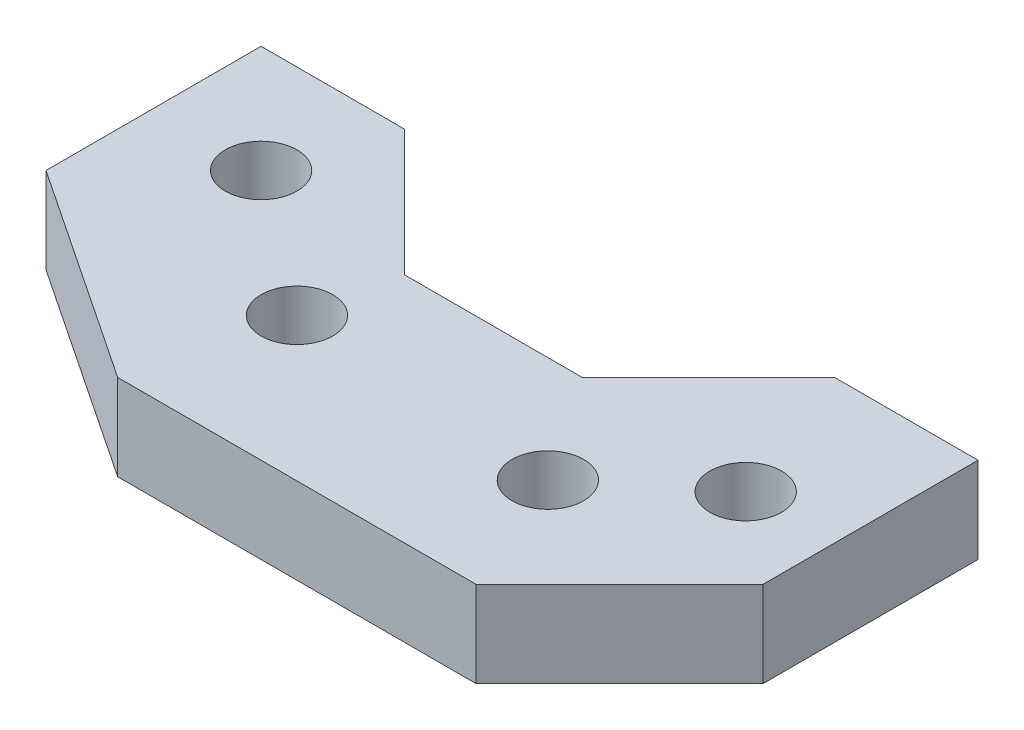
ISO-10303-21;
HEADER;
FILE_DESCRIPTION(('STEP AP214'),'2;1');
FILE_NAME('part.step','',(''),(''),'','','');
FILE_SCHEMA(('AUTOMOTIVE_DESIGN { 1 0 10303 214 1 1 1 1 }'));
ENDSEC;
DATA;
#1=APPLICATION_CONTEXT('core data for automotive mechanical design processes');
#2=APPLICATION_PROTOCOL_DEFINITION('international standard','automotive_design',2000,#1);
#3=PRODUCT_CONTEXT('',#1,'mechanical');
#4=PRODUCT('Part','Part','',(#3));
#5=PRODUCT_RELATED_PRODUCT_CATEGORY('part','',(#4));
#6=PRODUCT_DEFINITION_FORMATION('','',#4);
#7=PRODUCT_DEFINITION_CONTEXT('part definition',#1,'design');
#8=PRODUCT_DEFINITION('design','',#6,#7);
#9=PRODUCT_DEFINITION_SHAPE('','',#8);
#10=(LENGTH_UNIT() NAMED_UNIT(*) SI_UNIT(.MILLI.,.METRE.));
#11=(NAMED_UNIT(*) PLANE_ANGLE_UNIT() SI_UNIT($,.RADIAN.));
#12=(NAMED_UNIT(*) SI_UNIT($,.STERADIAN.) SOLID_ANGLE_UNIT());
#13=UNCERTAINTY_MEASURE_WITH_UNIT(LENGTH_MEASURE(1.E-05),#10,'distance_accuracy_value','');
#14=(GEOMETRIC_REPRESENTATION_CONTEXT(3) GLOBAL_UNCERTAINTY_ASSIGNED_CONTEXT((#13)) GLOBAL_UNIT_ASSIGNED_CONTEXT((#10,
#11,#12)) REPRESENTATION_CONTEXT('',''));
#15=CARTESIAN_POINT('',(0.,0.,0.));
#16=DIRECTION('',(0.,0.,1.));
#17=DIRECTION('',(1.,0.,0.));
#18=AXIS2_PLACEMENT_3D('',#15,#16,#17);
#19=CARTESIAN_POINT('',(0.,15.24,0.));
#20=DIRECTION('',(0.,1.,0.));
#21=DIRECTION('',(0.,0.,1.));
#22=AXIS2_PLACEMENT_3D('',#19,#20,#21);
#23=PLANE('',#22);
#24=CARTESIAN_POINT('',(111.252,15.24,25.4));
#25=DIRECTION('',(0.,1.,0.));
#26=DIRECTION('',(0.,0.,1.));
#27=AXIS2_PLACEMENT_3D('',#24,#25,#26);
#28=CIRCLE('',#27,6.35000000000001);
#29=CARTESIAN_POINT('',(111.252,15.24,31.75));
#30=VERTEX_POINT('',#29);
#31=EDGE_CURVE('E257',#30,#30,#28,.T.);
#32=ORIENTED_EDGE('',*,*,#31,.F.);
#33=EDGE_LOOP('',(#32));
#34=FACE_BOUND('',#33,.T.);
#35=CARTESIAN_POINT('',(44.45,15.24,38.1));
#36=DIRECTION('',(0.,1.,0.));
#37=DIRECTION('',(0.,0.,1.));
#38=AXIS2_PLACEMENT_3D('',#35,#36,#37);
#39=CIRCLE('',#38,6.35);
#40=CARTESIAN_POINT('',(44.45,15.24,44.45));
#41=VERTEX_POINT('',#40);
#42=EDGE_CURVE('E158',#41,#41,#39,.T.);
#43=ORIENTED_EDGE('',*,*,#42,.F.);
#44=EDGE_LOOP('',(#43));
#45=FACE_BOUND('',#44,.T.);
#46=DIRECTION('',(-1.,0.,0.));
#47=VECTOR('',#46,1.);
#48=CARTESIAN_POINT('',(25.4,15.24,0.));
#49=LINE('',#48,#47);
#50=CARTESIAN_POINT('',(25.4,15.24,0.));
#51=VERTEX_POINT('',#50);
#52=CARTESIAN_POINT('',(0.,15.24,0.));
#53=VERTEX_POINT('',#52);
#54=EDGE_CURVE('E182',#51,#53,#49,.T.);
#55=ORIENTED_EDGE('',*,*,#54,.T.);
#56=DIRECTION('',(0.,0.,1.));
#57=VECTOR('',#56,1.);
#58=CARTESIAN_POINT('',(0.,15.24,0.));
#59=LINE('',#58,#57);
#60=CARTESIAN_POINT('',(0.,15.24,38.1));
#61=VERTEX_POINT('',#60);
#62=EDGE_CURVE('E106',#53,#61,#59,.T.);
#63=ORIENTED_EDGE('',*,*,#62,.T.);
#64=DIRECTION('',(0.832050294337844,0.,0.554700196225229));
#65=VECTOR('',#64,1.);
#66=CARTESIAN_POINT('',(0.,15.24,38.1));
#67=LINE('',#66,#65);
#68=CARTESIAN_POINT('',(38.1,15.24,63.5));
#69=VERTEX_POINT('',#68);
#70=EDGE_CURVE('E211',#61,#69,#67,.T.);
#71=ORIENTED_EDGE('',*,*,#70,.T.);
#72=DIRECTION('',(1.,0.,0.));
#73=VECTOR('',#72,1.);
#74=CARTESIAN_POINT('',(38.1,15.24,63.5));
#75=LINE('',#74,#73);
#76=CARTESIAN_POINT('',(101.6,15.24,63.5));
#77=VERTEX_POINT('',#76);
#78=EDGE_CURVE('E231',#69,#77,#75,.T.);
#79=ORIENTED_EDGE('',*,*,#78,.T.);
#80=DIRECTION('',(0.707106781186546,0.,-0.707106781186549));
#81=VECTOR('',#80,1.);
#82=CARTESIAN_POINT('',(101.6,15.24,63.5));
#83=LINE('',#82,#81);
#84=CARTESIAN_POINT('',(127.,15.24,38.0999999999999));
#85=VERTEX_POINT('',#84);
#86=EDGE_CURVE('E227',#77,#85,#83,.T.);
#87=ORIENTED_EDGE('',*,*,#86,.T.);
#88=DIRECTION('',(0.,0.,-1.));
#89=VECTOR('',#88,1.);
#90=CARTESIAN_POINT('',(127.,15.24,38.0999999999999));
#91=LINE('',#90,#89);
#92=CARTESIAN_POINT('',(127.,15.24,0.));
#93=VERTEX_POINT('',#92);
#94=EDGE_CURVE('E230',#85,#93,#91,.T.);
#95=ORIENTED_EDGE('',*,*,#94,.T.);
#96=DIRECTION('',(-1.,0.,0.));
#97=VECTOR('',#96,1.);
#98=CARTESIAN_POINT('',(127.,15.24,0.));
#99=LINE('',#98,#97);
#100=CARTESIAN_POINT('',(101.6,15.24,0.));
#101=VERTEX_POINT('',#100);
#102=EDGE_CURVE('E131',#93,#101,#99,.T.);
#103=ORIENTED_EDGE('',*,*,#102,.T.);
#104=DIRECTION('',(-0.707106781186547,0.,0.707106781186548));
#105=VECTOR('',#104,1.);
#106=CARTESIAN_POINT('',(101.6,15.24,0.));
#107=LINE('',#106,#105);
#108=CARTESIAN_POINT('',(79.248,15.24,22.352));
#109=VERTEX_POINT('',#108);
#110=EDGE_CURVE('E125',#101,#109,#107,.T.);
#111=ORIENTED_EDGE('',*,*,#110,.T.);
#112=DIRECTION('',(-1.,0.,0.));
#113=VECTOR('',#112,1.);
#114=CARTESIAN_POINT('',(47.752,15.24,22.352));
#115=LINE('',#114,#113);
#116=CARTESIAN_POINT('',(47.752,15.24,22.352));
#117=VERTEX_POINT('',#116);
#118=EDGE_CURVE('E129',#109,#117,#115,.T.);
#119=ORIENTED_EDGE('',*,*,#118,.T.);
#120=DIRECTION('',(-0.707106781186548,0.,-0.707106781186547));
#121=VECTOR('',#120,1.);
#122=CARTESIAN_POINT('',(47.752,15.24,22.352));
#123=LINE('',#122,#121);
#124=EDGE_CURVE('E57',#117,#51,#123,.T.);
#125=ORIENTED_EDGE('',*,*,#124,.T.);
#126=EDGE_LOOP('',(#55,#63,#71,#79,#87,#95,#103,#111,#119,#125));
#127=FACE_BOUND('',#126,.T.);
#128=CARTESIAN_POINT('',(91.948,15.24,41.148));
#129=DIRECTION('',(0.,1.,0.));
#130=DIRECTION('',(0.,0.,1.));
#131=AXIS2_PLACEMENT_3D('',#128,#129,#130);
#132=CIRCLE('',#131,6.35000000000002);
#133=CARTESIAN_POINT('',(91.948,15.24,47.498));
#134=VERTEX_POINT('',#133);
#135=EDGE_CURVE('E249',#134,#134,#132,.T.);
#136=ORIENTED_EDGE('',*,*,#135,.F.);
#137=EDGE_LOOP('',(#136));
#138=FACE_BOUND('',#137,.T.);
#139=CARTESIAN_POINT('',(19.05,15.24,19.05));
#140=DIRECTION('',(0.,1.,0.));
#141=DIRECTION('',(0.,0.,1.));
#142=AXIS2_PLACEMENT_3D('',#139,#140,#141);
#143=CIRCLE('',#142,6.35);
#144=CARTESIAN_POINT('',(19.05,15.24,25.4));
#145=VERTEX_POINT('',#144);
#146=EDGE_CURVE('E265',#145,#145,#143,.T.);
#147=ORIENTED_EDGE('',*,*,#146,.F.);
#148=EDGE_LOOP('',(#147));
#149=FACE_BOUND('',#148,.T.);
#150=ADVANCED_FACE('F39',(#34,#45,#127,#138,#149),#23,.T.);
#151=CARTESIAN_POINT('',(0.,0.,0.));
#152=DIRECTION('',(0.,1.,0.));
#153=DIRECTION('',(0.,0.,1.));
#154=AXIS2_PLACEMENT_3D('',#151,#152,#153);
#155=PLANE('',#154);
#156=DIRECTION('',(-1.,0.,0.));
#157=VECTOR('',#156,1.);
#158=CARTESIAN_POINT('',(25.4,0.,0.));
#159=LINE('',#158,#157);
#160=CARTESIAN_POINT('',(25.4,0.,0.));
#161=VERTEX_POINT('',#160);
#162=CARTESIAN_POINT('',(0.,0.,0.));
#163=VERTEX_POINT('',#162);
#164=EDGE_CURVE('E153',#161,#163,#159,.T.);
#165=ORIENTED_EDGE('',*,*,#164,.F.);
#166=DIRECTION('',(-0.707106781186548,0.,-0.707106781186547));
#167=VECTOR('',#166,1.);
#168=CARTESIAN_POINT('',(47.752,0.,22.352));
#169=LINE('',#168,#167);
#170=CARTESIAN_POINT('',(47.752,0.,22.352));
#171=VERTEX_POINT('',#170);
#172=EDGE_CURVE('E98',#171,#161,#169,.T.);
#173=ORIENTED_EDGE('',*,*,#172,.F.);
#174=DIRECTION('',(-1.,0.,0.));
#175=VECTOR('',#174,1.);
#176=CARTESIAN_POINT('',(47.752,0.,22.352));
#177=LINE('',#176,#175);
#178=CARTESIAN_POINT('',(79.248,0.,22.352));
#179=VERTEX_POINT('',#178);
#180=EDGE_CURVE('E92',#179,#171,#177,.T.);
#181=ORIENTED_EDGE('',*,*,#180,.F.);
#182=DIRECTION('',(-0.707106781186547,0.,0.707106781186548));
#183=VECTOR('',#182,1.);
#184=CARTESIAN_POINT('',(101.6,0.,0.));
#185=LINE('',#184,#183);
#186=CARTESIAN_POINT('',(101.6,0.,0.));
#187=VERTEX_POINT('',#186);
#188=EDGE_CURVE('E140',#187,#179,#185,.T.);
#189=ORIENTED_EDGE('',*,*,#188,.F.);
#190=DIRECTION('',(-1.,0.,0.));
#191=VECTOR('',#190,1.);
#192=CARTESIAN_POINT('',(127.,0.,0.));
#193=LINE('',#192,#191);
#194=CARTESIAN_POINT('',(127.,0.,0.));
#195=VERTEX_POINT('',#194);
#196=EDGE_CURVE('E173',#195,#187,#193,.T.);
#197=ORIENTED_EDGE('',*,*,#196,.F.);
#198=DIRECTION('',(0.,0.,-1.));
#199=VECTOR('',#198,1.);
#200=CARTESIAN_POINT('',(127.,0.,38.0999999999999));
#201=LINE('',#200,#199);
#202=CARTESIAN_POINT('',(127.,0.,38.0999999999999));
#203=VERTEX_POINT('',#202);
#204=EDGE_CURVE('E170',#203,#195,#201,.T.);
#205=ORIENTED_EDGE('',*,*,#204,.F.);
#206=DIRECTION('',(0.707106781186546,0.,-0.707106781186549));
#207=VECTOR('',#206,1.);
#208=CARTESIAN_POINT('',(101.6,0.,63.5));
#209=LINE('',#208,#207);
#210=CARTESIAN_POINT('',(101.6,0.,63.5));
#211=VERTEX_POINT('',#210);
#212=EDGE_CURVE('E167',#211,#203,#209,.T.);
#213=ORIENTED_EDGE('',*,*,#212,.F.);
#214=DIRECTION('',(1.,0.,0.));
#215=VECTOR('',#214,1.);
#216=CARTESIAN_POINT('',(38.1,0.,63.5));
#217=LINE('',#216,#215);
#218=CARTESIAN_POINT('',(38.1,0.,63.5));
#219=VERTEX_POINT('',#218);
#220=EDGE_CURVE('E164',#219,#211,#217,.T.);
#221=ORIENTED_EDGE('',*,*,#220,.F.);
#222=DIRECTION('',(0.832050294337844,0.,0.554700196225229));
#223=VECTOR('',#222,1.);
#224=CARTESIAN_POINT('',(0.,0.,38.1));
#225=LINE('',#224,#223);
#226=CARTESIAN_POINT('',(0.,0.,38.1));
#227=VERTEX_POINT('',#226);
#228=EDGE_CURVE('E161',#227,#219,#225,.T.);
#229=ORIENTED_EDGE('',*,*,#228,.F.);
#230=DIRECTION('',(0.,0.,1.));
#231=VECTOR('',#230,1.);
#232=CARTESIAN_POINT('',(0.,0.,0.));
#233=LINE('',#232,#231);
#234=EDGE_CURVE('E157',#163,#227,#233,.T.);
#235=ORIENTED_EDGE('',*,*,#234,.F.);
#236=EDGE_LOOP('',(#165,#173,#181,#189,#197,#205,#213,#221,#229,#235));
#237=FACE_BOUND('',#236,.T.);
#238=CARTESIAN_POINT('',(44.45,0.,38.1));
#239=DIRECTION('',(0.,1.,0.));
#240=DIRECTION('',(0.,0.,1.));
#241=AXIS2_PLACEMENT_3D('',#238,#239,#240);
#242=CIRCLE('',#241,6.35);
#243=CARTESIAN_POINT('',(44.45,0.,44.45));
#244=VERTEX_POINT('',#243);
#245=EDGE_CURVE('E245',#244,#244,#242,.T.);
#246=ORIENTED_EDGE('',*,*,#245,.T.);
#247=EDGE_LOOP('',(#246));
#248=FACE_BOUND('',#247,.T.);
#249=CARTESIAN_POINT('',(91.948,0.,41.148));
#250=DIRECTION('',(0.,1.,0.));
#251=DIRECTION('',(0.,0.,1.));
#252=AXIS2_PLACEMENT_3D('',#249,#250,#251);
#253=CIRCLE('',#252,6.35000000000002);
#254=CARTESIAN_POINT('',(91.948,0.,47.498));
#255=VERTEX_POINT('',#254);
#256=EDGE_CURVE('E253',#255,#255,#253,.T.);
#257=ORIENTED_EDGE('',*,*,#256,.T.);
#258=EDGE_LOOP('',(#257));
#259=FACE_BOUND('',#258,.T.);
#260=CARTESIAN_POINT('',(111.252,0.,25.4));
#261=DIRECTION('',(0.,1.,0.));
#262=DIRECTION('',(0.,0.,1.));
#263=AXIS2_PLACEMENT_3D('',#260,#261,#262);
#264=CIRCLE('',#263,6.35000000000001);
#265=CARTESIAN_POINT('',(111.252,0.,31.75));
#266=VERTEX_POINT('',#265);
#267=EDGE_CURVE('E261',#266,#266,#264,.T.);
#268=ORIENTED_EDGE('',*,*,#267,.T.);
#269=EDGE_LOOP('',(#268));
#270=FACE_BOUND('',#269,.T.);
#271=CARTESIAN_POINT('',(19.05,0.,19.05));
#272=DIRECTION('',(0.,1.,0.));
#273=DIRECTION('',(0.,0.,1.));
#274=AXIS2_PLACEMENT_3D('',#271,#272,#273);
#275=CIRCLE('',#274,6.35);
#276=CARTESIAN_POINT('',(19.05,0.,25.4));
#277=VERTEX_POINT('',#276);
#278=EDGE_CURVE('E269',#277,#277,#275,.T.);
#279=ORIENTED_EDGE('',*,*,#278,.T.);
#280=EDGE_LOOP('',(#279));
#281=FACE_BOUND('',#280,.T.);
#282=ADVANCED_FACE('F215',(#237,#248,#259,#270,#281),#155,.F.);
#283=CARTESIAN_POINT('',(25.4,15.24,0.));
#284=DIRECTION('',(0.,0.,1.));
#285=DIRECTION('',(1.,0.,0.));
#286=AXIS2_PLACEMENT_3D('',#283,#284,#285);
#287=PLANE('',#286);
#288=ORIENTED_EDGE('',*,*,#164,.T.);
#289=DIRECTION('',(0.,-1.,0.));
#290=VECTOR('',#289,1.);
#291=CARTESIAN_POINT('',(0.,15.24,0.));
#292=LINE('',#291,#290);
#293=EDGE_CURVE('E11',#53,#163,#292,.T.);
#294=ORIENTED_EDGE('',*,*,#293,.F.);
#295=ORIENTED_EDGE('',*,*,#54,.F.);
#296=DIRECTION('',(0.,-1.,0.));
#297=VECTOR('',#296,1.);
#298=CARTESIAN_POINT('',(25.4,15.24,0.));
#299=LINE('',#298,#297);
#300=EDGE_CURVE('E149',#51,#161,#299,.T.);
#301=ORIENTED_EDGE('',*,*,#300,.T.);
#302=EDGE_LOOP('',(#288,#294,#295,#301));
#303=FACE_BOUND('',#302,.T.);
#304=ADVANCED_FACE('F41',(#303),#287,.F.);
#305=CARTESIAN_POINT('',(0.,15.24,0.));
#306=DIRECTION('',(1.,0.,0.));
#307=DIRECTION('',(0.,0.,-1.));
#308=AXIS2_PLACEMENT_3D('',#305,#306,#307);
#309=PLANE('',#308);
#310=ORIENTED_EDGE('',*,*,#234,.T.);
#311=DIRECTION('',(0.,-1.,0.));
#312=VECTOR('',#311,1.);
#313=CARTESIAN_POINT('',(0.,15.24,38.1));
#314=LINE('',#313,#312);
#315=EDGE_CURVE('E49',#61,#227,#314,.T.);
#316=ORIENTED_EDGE('',*,*,#315,.F.);
#317=ORIENTED_EDGE('',*,*,#62,.F.);
#318=ORIENTED_EDGE('',*,*,#293,.T.);
#319=EDGE_LOOP('',(#310,#316,#317,#318));
#320=FACE_BOUND('',#319,.T.);
#321=ADVANCED_FACE('F313',(#320),#309,.F.);
#322=CARTESIAN_POINT('',(0.,15.24,38.1));
#323=DIRECTION('',(0.554700196225229,0.,-0.832050294337844));
#324=DIRECTION('',(-0.832050294337844,0.,-0.554700196225229));
#325=AXIS2_PLACEMENT_3D('',#322,#323,#324);
#326=PLANE('',#325);
#327=ORIENTED_EDGE('',*,*,#228,.T.);
#328=DIRECTION('',(0.,-1.,0.));
#329=VECTOR('',#328,1.);
#330=CARTESIAN_POINT('',(38.1,15.24,63.5));
#331=LINE('',#330,#329);
#332=EDGE_CURVE('E201',#69,#219,#331,.T.);
#333=ORIENTED_EDGE('',*,*,#332,.F.);
#334=ORIENTED_EDGE('',*,*,#70,.F.);
#335=ORIENTED_EDGE('',*,*,#315,.T.);
#336=EDGE_LOOP('',(#327,#333,#334,#335));
#337=FACE_BOUND('',#336,.T.);
#338=ADVANCED_FACE('F209',(#337),#326,.F.);
#339=CARTESIAN_POINT('',(38.1,15.24,63.5));
#340=DIRECTION('',(0.,0.,-1.));
#341=DIRECTION('',(-1.,0.,0.));
#342=AXIS2_PLACEMENT_3D('',#339,#340,#341);
#343=PLANE('',#342);
#344=ORIENTED_EDGE('',*,*,#220,.T.);
#345=DIRECTION('',(0.,-1.,0.));
#346=VECTOR('',#345,1.);
#347=CARTESIAN_POINT('',(101.6,15.24,63.5));
#348=LINE('',#347,#346);
#349=EDGE_CURVE('E197',#77,#211,#348,.T.);
#350=ORIENTED_EDGE('',*,*,#349,.F.);
#351=ORIENTED_EDGE('',*,*,#78,.F.);
#352=ORIENTED_EDGE('',*,*,#332,.T.);
#353=EDGE_LOOP('',(#344,#350,#351,#352));
#354=FACE_BOUND('',#353,.T.);
#355=ADVANCED_FACE('F221',(#354),#343,.F.);
#356=CARTESIAN_POINT('',(101.6,15.24,63.5));
#357=DIRECTION('',(-0.707106781186549,0.,-0.707106781186546));
#358=DIRECTION('',(-0.707106781186546,0.,0.707106781186549));
#359=AXIS2_PLACEMENT_3D('',#356,#357,#358);
#360=PLANE('',#359);
#361=ORIENTED_EDGE('',*,*,#212,.T.);
#362=DIRECTION('',(0.,-1.,0.));
#363=VECTOR('',#362,1.);
#364=CARTESIAN_POINT('',(127.,15.24,38.0999999999999));
#365=LINE('',#364,#363);
#366=EDGE_CURVE('E193',#85,#203,#365,.T.);
#367=ORIENTED_EDGE('',*,*,#366,.F.);
#368=ORIENTED_EDGE('',*,*,#86,.F.);
#369=ORIENTED_EDGE('',*,*,#349,.T.);
#370=EDGE_LOOP('',(#361,#367,#368,#369));
#371=FACE_BOUND('',#370,.T.);
#372=ADVANCED_FACE('F225',(#371),#360,.F.);
#373=CARTESIAN_POINT('',(127.,15.24,38.0999999999999));
#374=DIRECTION('',(-1.,0.,0.));
#375=DIRECTION('',(0.,0.,1.));
#376=AXIS2_PLACEMENT_3D('',#373,#374,#375);
#377=PLANE('',#376);
#378=ORIENTED_EDGE('',*,*,#204,.T.);
#379=DIRECTION('',(0.,-1.,0.));
#380=VECTOR('',#379,1.);
#381=CARTESIAN_POINT('',(127.,15.24,0.));
#382=LINE('',#381,#380);
#383=EDGE_CURVE('E189',#93,#195,#382,.T.);
#384=ORIENTED_EDGE('',*,*,#383,.F.);
#385=ORIENTED_EDGE('',*,*,#94,.F.);
#386=ORIENTED_EDGE('',*,*,#366,.T.);
#387=EDGE_LOOP('',(#378,#384,#385,#386));
#388=FACE_BOUND('',#387,.T.);
#389=ADVANCED_FACE('F303',(#388),#377,.F.);
#390=CARTESIAN_POINT('',(127.,15.24,0.));
#391=DIRECTION('',(0.,0.,1.));
#392=DIRECTION('',(1.,0.,0.));
#393=AXIS2_PLACEMENT_3D('',#390,#391,#392);
#394=PLANE('',#393);
#395=ORIENTED_EDGE('',*,*,#196,.T.);
#396=DIRECTION('',(0.,-1.,0.));
#397=VECTOR('',#396,1.);
#398=CARTESIAN_POINT('',(101.6,15.24,0.));
#399=LINE('',#398,#397);
#400=EDGE_CURVE('E142',#101,#187,#399,.T.);
#401=ORIENTED_EDGE('',*,*,#400,.F.);
#402=ORIENTED_EDGE('',*,*,#102,.F.);
#403=ORIENTED_EDGE('',*,*,#383,.T.);
#404=EDGE_LOOP('',(#395,#401,#402,#403));
#405=FACE_BOUND('',#404,.T.);
#406=ADVANCED_FACE('F300',(#405),#394,.F.);
#407=CARTESIAN_POINT('',(101.6,15.24,0.));
#408=DIRECTION('',(0.707106781186548,0.,0.707106781186547));
#409=DIRECTION('',(0.707106781186547,0.,-0.707106781186548));
#410=AXIS2_PLACEMENT_3D('',#407,#408,#409);
#411=PLANE('',#410);
#412=ORIENTED_EDGE('',*,*,#188,.T.);
#413=DIRECTION('',(0.,-1.,0.));
#414=VECTOR('',#413,1.);
#415=CARTESIAN_POINT('',(79.248,15.24,22.352));
#416=LINE('',#415,#414);
#417=EDGE_CURVE('E137',#109,#179,#416,.T.);
#418=ORIENTED_EDGE('',*,*,#417,.F.);
#419=ORIENTED_EDGE('',*,*,#110,.F.);
#420=ORIENTED_EDGE('',*,*,#400,.T.);
#421=EDGE_LOOP('',(#412,#418,#419,#420));
#422=FACE_BOUND('',#421,.T.);
#423=ADVANCED_FACE('F138',(#422),#411,.F.);
#424=CARTESIAN_POINT('',(47.752,15.24,22.352));
#425=DIRECTION('',(0.,0.,1.));
#426=DIRECTION('',(1.,0.,0.));
#427=AXIS2_PLACEMENT_3D('',#424,#425,#426);
#428=PLANE('',#427);
#429=ORIENTED_EDGE('',*,*,#180,.T.);
#430=DIRECTION('',(0.,-1.,0.));
#431=VECTOR('',#430,1.);
#432=CARTESIAN_POINT('',(47.752,15.24,22.352));
#433=LINE('',#432,#431);
#434=EDGE_CURVE('E143',#117,#171,#433,.T.);
#435=ORIENTED_EDGE('',*,*,#434,.F.);
#436=ORIENTED_EDGE('',*,*,#118,.F.);
#437=ORIENTED_EDGE('',*,*,#417,.T.);
#438=EDGE_LOOP('',(#429,#435,#436,#437));
#439=FACE_BOUND('',#438,.T.);
#440=ADVANCED_FACE('F145',(#439),#428,.F.);
#441=CARTESIAN_POINT('',(47.752,15.24,22.352));
#442=DIRECTION('',(-0.707106781186547,0.,0.707106781186548));
#443=DIRECTION('',(0.707106781186548,0.,0.707106781186547));
#444=AXIS2_PLACEMENT_3D('',#441,#442,#443);
#445=PLANE('',#444);
#446=ORIENTED_EDGE('',*,*,#172,.T.);
#447=ORIENTED_EDGE('',*,*,#300,.F.);
#448=ORIENTED_EDGE('',*,*,#124,.F.);
#449=ORIENTED_EDGE('',*,*,#434,.T.);
#450=EDGE_LOOP('',(#446,#447,#448,#449));
#451=FACE_BOUND('',#450,.T.);
#452=ADVANCED_FACE('F293',(#451),#445,.F.);
#453=CARTESIAN_POINT('',(44.45,15.24,38.1));
#454=DIRECTION('',(0.,-1.,0.));
#455=DIRECTION('',(0.,0.,-1.));
#456=AXIS2_PLACEMENT_3D('',#453,#454,#455);
#457=CYLINDRICAL_SURFACE('',#456,6.35);
#458=ORIENTED_EDGE('',*,*,#42,.T.);
#459=EDGE_LOOP('',(#458));
#460=FACE_BOUND('',#459,.T.);
#461=ORIENTED_EDGE('',*,*,#245,.F.);
#462=EDGE_LOOP('',(#461));
#463=FACE_BOUND('',#462,.T.);
#464=ADVANCED_FACE('F290',(#460,#463),#457,.F.);
#465=CARTESIAN_POINT('',(91.948,15.24,41.148));
#466=DIRECTION('',(0.,-1.,0.));
#467=DIRECTION('',(0.,0.,-1.));
#468=AXIS2_PLACEMENT_3D('',#465,#466,#467);
#469=CYLINDRICAL_SURFACE('',#468,6.35000000000002);
#470=ORIENTED_EDGE('',*,*,#135,.T.);
#471=EDGE_LOOP('',(#470));
#472=FACE_BOUND('',#471,.T.);
#473=ORIENTED_EDGE('',*,*,#256,.F.);
#474=EDGE_LOOP('',(#473));
#475=FACE_BOUND('',#474,.T.);
#476=ADVANCED_FACE('F389',(#472,#475),#469,.F.);
#477=CARTESIAN_POINT('',(111.252,15.24,25.4));
#478=DIRECTION('',(0.,-1.,0.));
#479=DIRECTION('',(0.,0.,-1.));
#480=AXIS2_PLACEMENT_3D('',#477,#478,#479);
#481=CYLINDRICAL_SURFACE('',#480,6.35000000000001);
#482=ORIENTED_EDGE('',*,*,#31,.T.);
#483=EDGE_LOOP('',(#482));
#484=FACE_BOUND('',#483,.T.);
#485=ORIENTED_EDGE('',*,*,#267,.F.);
#486=EDGE_LOOP('',(#485));
#487=FACE_BOUND('',#486,.T.);
#488=ADVANCED_FACE('F397',(#484,#487),#481,.F.);
#489=CARTESIAN_POINT('',(19.05,15.24,19.05));
#490=DIRECTION('',(0.,-1.,0.));
#491=DIRECTION('',(0.,0.,-1.));
#492=AXIS2_PLACEMENT_3D('',#489,#490,#491);
#493=CYLINDRICAL_SURFACE('',#492,6.35);
#494=ORIENTED_EDGE('',*,*,#146,.T.);
#495=EDGE_LOOP('',(#494));
#496=FACE_BOUND('',#495,.T.);
#497=ORIENTED_EDGE('',*,*,#278,.F.);
#498=EDGE_LOOP('',(#497));
#499=FACE_BOUND('',#498,.T.);
#500=ADVANCED_FACE('F277',(#496,#499),#493,.F.);
#501=CLOSED_SHELL('',(#150,#282,#304,#321,#338,#355,#372,#389,#406,#423,#440,#452,#464,#476,
#488,#500));
#502=MANIFOLD_SOLID_BREP('B2',#501);
#503=ADVANCED_BREP_SHAPE_REPRESENTATION('',(#18,#502),#14);
#504=SHAPE_DEFINITION_REPRESENTATION(#9,#503);
ENDSEC;
END-ISO-10303-21;
